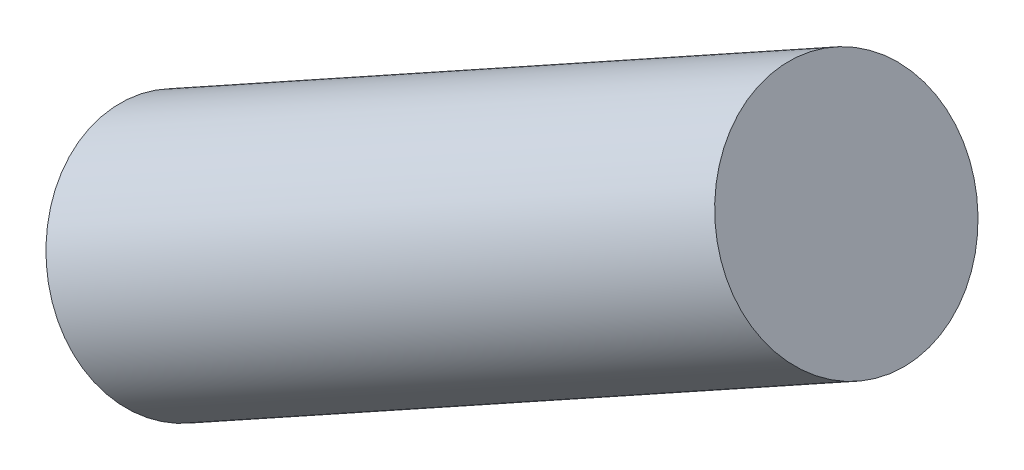
ISO-10303-21;
HEADER;
FILE_DESCRIPTION(('STEP AP214'),'2;1');
FILE_NAME('part.step','',(''),(''),'','','');
FILE_SCHEMA(('AUTOMOTIVE_DESIGN { 1 0 10303 214 1 1 1 1 }'));
ENDSEC;
DATA;
#1=APPLICATION_CONTEXT('core data for automotive mechanical design processes');
#2=APPLICATION_PROTOCOL_DEFINITION('international standard','automotive_design',2000,#1);
#3=PRODUCT_CONTEXT('',#1,'mechanical');
#4=PRODUCT('Part','Part','',(#3));
#5=PRODUCT_RELATED_PRODUCT_CATEGORY('part','',(#4));
#6=PRODUCT_DEFINITION_FORMATION('','',#4);
#7=PRODUCT_DEFINITION_CONTEXT('part definition',#1,'design');
#8=PRODUCT_DEFINITION('design','',#6,#7);
#9=PRODUCT_DEFINITION_SHAPE('','',#8);
#10=(LENGTH_UNIT() NAMED_UNIT(*) SI_UNIT(.MILLI.,.METRE.));
#11=(NAMED_UNIT(*) PLANE_ANGLE_UNIT() SI_UNIT($,.RADIAN.));
#12=(NAMED_UNIT(*) SI_UNIT($,.STERADIAN.) SOLID_ANGLE_UNIT());
#13=UNCERTAINTY_MEASURE_WITH_UNIT(LENGTH_MEASURE(1.E-05),#10,'distance_accuracy_value','');
#14=(GEOMETRIC_REPRESENTATION_CONTEXT(3) GLOBAL_UNCERTAINTY_ASSIGNED_CONTEXT((#13)) GLOBAL_UNIT_ASSIGNED_CONTEXT((#10,
#11,#12)) REPRESENTATION_CONTEXT('',''));
#15=CARTESIAN_POINT('',(0.,0.,0.));
#16=DIRECTION('',(0.,0.,1.));
#17=DIRECTION('',(1.,0.,0.));
#18=AXIS2_PLACEMENT_3D('',#15,#16,#17);
#19=CARTESIAN_POINT('',(193.385912141819,182.052886073901,0.));
#20=DIRECTION('',(-0.874619707139397,-0.484809620246335,0.));
#21=DIRECTION('',(0.484809620246335,-0.874619707139397,0.));
#22=AXIS2_PLACEMENT_3D('',#19,#20,#21);
#23=PLANE('',#22);
#24=CARTESIAN_POINT('',(193.385912141819,182.052886073901,0.));
#25=DIRECTION('',(-0.874619707139397,-0.484809620246335,0.));
#26=DIRECTION('',(0.484809620246335,-0.874619707139397,0.));
#27=AXIS2_PLACEMENT_3D('',#24,#25,#26);
#28=CIRCLE('',#27,46.5);
#29=CARTESIAN_POINT('',(215.929559483274,141.383069691919,0.));
#30=VERTEX_POINT('',#29);
#31=EDGE_CURVE('E47',#30,#30,#28,.T.);
#32=ORIENTED_EDGE('',*,*,#31,.F.);
#33=EDGE_LOOP('',(#32));
#34=FACE_BOUND('',#33,.T.);
#35=ADVANCED_FACE('F41',(#34),#23,.F.);
#36=CARTESIAN_POINT('',(-68.9999999999999,36.6100000000001,0.));
#37=DIRECTION('',(-0.874619707139397,-0.484809620246335,0.));
#38=DIRECTION('',(0.484809620246335,-0.874619707139397,0.));
#39=AXIS2_PLACEMENT_3D('',#36,#37,#38);
#40=PLANE('',#39);
#41=CARTESIAN_POINT('',(-68.9999999999999,36.6100000000001,0.));
#42=DIRECTION('',(-0.874619707139397,-0.484809620246335,0.));
#43=DIRECTION('',(0.484809620246335,-0.874619707139397,0.));
#44=AXIS2_PLACEMENT_3D('',#41,#42,#43);
#45=CIRCLE('',#44,46.5);
#46=CARTESIAN_POINT('',(-46.4563526585453,-4.0598163819819,0.));
#47=VERTEX_POINT('',#46);
#48=EDGE_CURVE('E11',#47,#47,#45,.T.);
#49=ORIENTED_EDGE('',*,*,#48,.T.);
#50=EDGE_LOOP('',(#49));
#51=FACE_BOUND('',#50,.T.);
#52=ADVANCED_FACE('F56',(#51),#40,.T.);
#53=CARTESIAN_POINT('',(193.385912141819,182.052886073901,0.));
#54=DIRECTION('',(-0.874619707139397,-0.484809620246335,0.));
#55=DIRECTION('',(0.484809620246335,-0.874619707139397,0.));
#56=AXIS2_PLACEMENT_3D('',#53,#54,#55);
#57=CYLINDRICAL_SURFACE('',#56,46.5);
#58=ORIENTED_EDGE('',*,*,#48,.F.);
#59=EDGE_LOOP('',(#58));
#60=FACE_BOUND('',#59,.T.);
#61=ORIENTED_EDGE('',*,*,#31,.T.);
#62=EDGE_LOOP('',(#61));
#63=FACE_BOUND('',#62,.T.);
#64=ADVANCED_FACE('F53',(#60,#63),#57,.T.);
#65=CLOSED_SHELL('',(#35,#52,#64));
#66=MANIFOLD_SOLID_BREP('B2',#65);
#67=ADVANCED_BREP_SHAPE_REPRESENTATION('',(#18,#66),#14);
#68=SHAPE_DEFINITION_REPRESENTATION(#9,#67);
ENDSEC;
END-ISO-10303-21;
